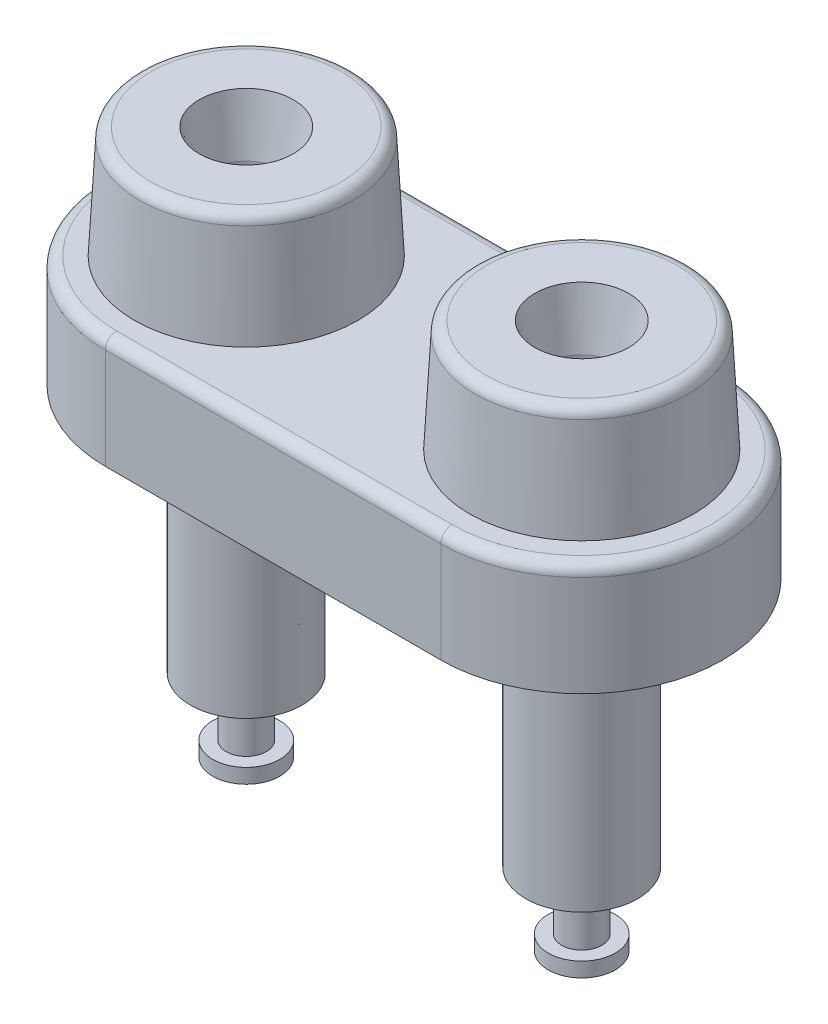
ISO-10303-21;
HEADER;
FILE_DESCRIPTION(('STEP AP214'),'2;1');
FILE_NAME('part.step','',(''),(''),'','','');
FILE_SCHEMA(('AUTOMOTIVE_DESIGN { 1 0 10303 214 1 1 1 1 }'));
ENDSEC;
DATA;
#1=APPLICATION_CONTEXT('core data for automotive mechanical design processes');
#2=APPLICATION_PROTOCOL_DEFINITION('international standard','automotive_design',2000,#1);
#3=PRODUCT_CONTEXT('',#1,'mechanical');
#4=PRODUCT('Part','Part','',(#3));
#5=PRODUCT_RELATED_PRODUCT_CATEGORY('part','',(#4));
#6=PRODUCT_DEFINITION_FORMATION('','',#4);
#7=PRODUCT_DEFINITION_CONTEXT('part definition',#1,'design');
#8=PRODUCT_DEFINITION('design','',#6,#7);
#9=PRODUCT_DEFINITION_SHAPE('','',#8);
#10=(LENGTH_UNIT() NAMED_UNIT(*) SI_UNIT(.MILLI.,.METRE.));
#11=(NAMED_UNIT(*) PLANE_ANGLE_UNIT() SI_UNIT($,.RADIAN.));
#12=(NAMED_UNIT(*) SI_UNIT($,.STERADIAN.) SOLID_ANGLE_UNIT());
#13=UNCERTAINTY_MEASURE_WITH_UNIT(LENGTH_MEASURE(1.E-05),#10,'distance_accuracy_value','');
#14=(GEOMETRIC_REPRESENTATION_CONTEXT(3) GLOBAL_UNCERTAINTY_ASSIGNED_CONTEXT((#13)) GLOBAL_UNIT_ASSIGNED_CONTEXT((#10,
#11,#12)) REPRESENTATION_CONTEXT('',''));
#15=CARTESIAN_POINT('',(0.,0.,0.));
#16=DIRECTION('',(0.,0.,1.));
#17=DIRECTION('',(1.,0.,0.));
#18=AXIS2_PLACEMENT_3D('',#15,#16,#17);
#19=CARTESIAN_POINT('',(-9.525,-0.889,0.));
#20=DIRECTION('',(0.,-1.,0.));
#21=DIRECTION('',(0.,0.,-1.));
#22=AXIS2_PLACEMENT_3D('',#19,#20,#21);
#23=PLANE('',#22);
#24=CARTESIAN_POINT('',(-9.525,-0.889,0.));
#25=DIRECTION('',(0.,-1.,0.));
#26=DIRECTION('',(0.,0.,-1.));
#27=AXIS2_PLACEMENT_3D('',#24,#25,#26);
#28=CIRCLE('',#27,4.699);
#29=CARTESIAN_POINT('',(-9.525,-0.889,-4.699));
#30=VERTEX_POINT('',#29);
#31=EDGE_CURVE('E225',#30,#30,#28,.T.);
#32=ORIENTED_EDGE('',*,*,#31,.T.);
#33=EDGE_LOOP('',(#32));
#34=FACE_BOUND('',#33,.T.);
#35=CARTESIAN_POINT('',(-9.525,-0.889,0.));
#36=DIRECTION('',(0.,-1.,0.));
#37=DIRECTION('',(0.,0.,-1.));
#38=AXIS2_PLACEMENT_3D('',#35,#36,#37);
#39=CIRCLE('',#38,3.175);
#40=CARTESIAN_POINT('',(-9.525,-0.889,-3.175));
#41=VERTEX_POINT('',#40);
#42=EDGE_CURVE('E178',#41,#41,#39,.T.);
#43=ORIENTED_EDGE('',*,*,#42,.F.);
#44=EDGE_LOOP('',(#43));
#45=FACE_BOUND('',#44,.T.);
#46=ADVANCED_FACE('F45',(#34,#45),#23,.T.);
#47=CARTESIAN_POINT('',(9.525,-0.889,0.));
#48=DIRECTION('',(0.,-1.,0.));
#49=DIRECTION('',(0.,0.,-1.));
#50=AXIS2_PLACEMENT_3D('',#47,#48,#49);
#51=PLANE('',#50);
#52=CARTESIAN_POINT('',(9.525,-0.889,0.));
#53=DIRECTION('',(0.,-1.,0.));
#54=DIRECTION('',(0.,0.,-1.));
#55=AXIS2_PLACEMENT_3D('',#52,#53,#54);
#56=CIRCLE('',#55,4.699);
#57=CARTESIAN_POINT('',(9.525,-0.889,-4.699));
#58=VERTEX_POINT('',#57);
#59=EDGE_CURVE('E222',#58,#58,#56,.T.);
#60=ORIENTED_EDGE('',*,*,#59,.T.);
#61=EDGE_LOOP('',(#60));
#62=FACE_BOUND('',#61,.T.);
#63=CARTESIAN_POINT('',(9.525,-0.889,0.));
#64=DIRECTION('',(0.,-1.,0.));
#65=DIRECTION('',(0.,0.,-1.));
#66=AXIS2_PLACEMENT_3D('',#63,#64,#65);
#67=CIRCLE('',#66,3.175);
#68=CARTESIAN_POINT('',(9.525,-0.889,-3.175));
#69=VERTEX_POINT('',#68);
#70=EDGE_CURVE('E204',#69,#69,#67,.T.);
#71=ORIENTED_EDGE('',*,*,#70,.F.);
#72=EDGE_LOOP('',(#71));
#73=FACE_BOUND('',#72,.T.);
#74=ADVANCED_FACE('F241',(#62,#73),#51,.T.);
#75=CARTESIAN_POINT('',(-9.525,0.,0.));
#76=DIRECTION('',(0.,1.,0.));
#77=DIRECTION('',(0.,0.,1.));
#78=AXIS2_PLACEMENT_3D('',#75,#76,#77);
#79=PLANE('',#78);
#80=CARTESIAN_POINT('',(-9.525,0.,0.));
#81=DIRECTION('',(0.,1.,0.));
#82=DIRECTION('',(0.,0.,1.));
#83=AXIS2_PLACEMENT_3D('',#80,#81,#82);
#84=CIRCLE('',#83,8.001);
#85=CARTESIAN_POINT('',(-9.525,0.,-8.001));
#86=VERTEX_POINT('',#85);
#87=CARTESIAN_POINT('',(-9.525,0.,8.001));
#88=VERTEX_POINT('',#87);
#89=EDGE_CURVE('E118',#86,#88,#84,.T.);
#90=ORIENTED_EDGE('',*,*,#89,.F.);
#91=DIRECTION('',(-1.,0.,0.));
#92=VECTOR('',#91,1.);
#93=CARTESIAN_POINT('',(-9.525,0.,-8.001));
#94=LINE('',#93,#92);
#95=CARTESIAN_POINT('',(9.525,0.,-8.001));
#96=VERTEX_POINT('',#95);
#97=EDGE_CURVE('E133',#96,#86,#94,.T.);
#98=ORIENTED_EDGE('',*,*,#97,.F.);
#99=CARTESIAN_POINT('',(9.525,0.,0.));
#100=DIRECTION('',(0.,1.,0.));
#101=DIRECTION('',(0.,0.,1.));
#102=AXIS2_PLACEMENT_3D('',#99,#100,#101);
#103=CIRCLE('',#102,8.001);
#104=CARTESIAN_POINT('',(9.525,0.,8.001));
#105=VERTEX_POINT('',#104);
#106=EDGE_CURVE('E120',#105,#96,#103,.T.);
#107=ORIENTED_EDGE('',*,*,#106,.F.);
#108=DIRECTION('',(1.,0.,0.));
#109=VECTOR('',#108,1.);
#110=CARTESIAN_POINT('',(-9.525,0.,8.001));
#111=LINE('',#110,#109);
#112=EDGE_CURVE('E103',#88,#105,#111,.T.);
#113=ORIENTED_EDGE('',*,*,#112,.F.);
#114=EDGE_LOOP('',(#90,#98,#107,#113));
#115=FACE_BOUND('',#114,.T.);
#116=CARTESIAN_POINT('',(-9.525,0.,0.));
#117=DIRECTION('',(0.,1.,0.));
#118=DIRECTION('',(0.,0.,1.));
#119=AXIS2_PLACEMENT_3D('',#116,#117,#118);
#120=CIRCLE('',#119,4.699);
#121=CARTESIAN_POINT('',(-9.525,0.,4.699));
#122=VERTEX_POINT('',#121);
#123=EDGE_CURVE('E110',#122,#122,#120,.F.);
#124=ORIENTED_EDGE('',*,*,#123,.F.);
#125=EDGE_LOOP('',(#124));
#126=FACE_BOUND('',#125,.T.);
#127=CARTESIAN_POINT('',(9.525,0.,0.));
#128=DIRECTION('',(0.,1.,0.));
#129=DIRECTION('',(0.,0.,1.));
#130=AXIS2_PLACEMENT_3D('',#127,#128,#129);
#131=CIRCLE('',#130,4.699);
#132=CARTESIAN_POINT('',(9.525,0.,4.699));
#133=VERTEX_POINT('',#132);
#134=EDGE_CURVE('E141',#133,#133,#131,.F.);
#135=ORIENTED_EDGE('',*,*,#134,.F.);
#136=EDGE_LOOP('',(#135));
#137=FACE_BOUND('',#136,.T.);
#138=ADVANCED_FACE('F115',(#115,#126,#137),#79,.F.);
#139=CARTESIAN_POINT('',(-9.525,6.35,0.));
#140=DIRECTION('',(0.,1.,0.));
#141=DIRECTION('',(0.,0.,1.));
#142=AXIS2_PLACEMENT_3D('',#139,#140,#141);
#143=PLANE('',#142);
#144=DIRECTION('',(-1.,0.,0.));
#145=VECTOR('',#144,1.);
#146=CARTESIAN_POINT('',(-9.525,6.35,-7.366));
#147=LINE('',#146,#145);
#148=CARTESIAN_POINT('',(9.525,6.35,-7.366));
#149=VERTEX_POINT('',#148);
#150=CARTESIAN_POINT('',(-9.525,6.35,-7.366));
#151=VERTEX_POINT('',#150);
#152=EDGE_CURVE('E148',#149,#151,#147,.T.);
#153=ORIENTED_EDGE('',*,*,#152,.T.);
#154=CARTESIAN_POINT('',(-9.525,6.35,0.));
#155=DIRECTION('',(0.,1.,0.));
#156=DIRECTION('',(0.,0.,1.));
#157=AXIS2_PLACEMENT_3D('',#154,#155,#156);
#158=CIRCLE('',#157,7.366);
#159=CARTESIAN_POINT('',(-9.525,6.35,7.366));
#160=VERTEX_POINT('',#159);
#161=EDGE_CURVE('E150',#151,#160,#158,.T.);
#162=ORIENTED_EDGE('',*,*,#161,.T.);
#163=DIRECTION('',(1.,0.,0.));
#164=VECTOR('',#163,1.);
#165=CARTESIAN_POINT('',(9.52500000000001,6.35,7.366));
#166=LINE('',#165,#164);
#167=CARTESIAN_POINT('',(9.525,6.35,7.366));
#168=VERTEX_POINT('',#167);
#169=EDGE_CURVE('E144',#160,#168,#166,.T.);
#170=ORIENTED_EDGE('',*,*,#169,.T.);
#171=CARTESIAN_POINT('',(9.525,6.35,0.));
#172=DIRECTION('',(0.,1.,0.));
#173=DIRECTION('',(0.,0.,1.));
#174=AXIS2_PLACEMENT_3D('',#171,#172,#173);
#175=CIRCLE('',#174,7.366);
#176=EDGE_CURVE('E146',#168,#149,#175,.T.);
#177=ORIENTED_EDGE('',*,*,#176,.T.);
#178=EDGE_LOOP('',(#153,#162,#170,#177));
#179=FACE_BOUND('',#178,.T.);
#180=CARTESIAN_POINT('',(-9.525,6.35,0.));
#181=DIRECTION('',(0.,1.,0.));
#182=DIRECTION('',(0.,0.,1.));
#183=AXIS2_PLACEMENT_3D('',#180,#181,#182);
#184=CIRCLE('',#183,6.35);
#185=CARTESIAN_POINT('',(-9.525,6.35,6.35));
#186=VERTEX_POINT('',#185);
#187=EDGE_CURVE('E125',#186,#186,#184,.T.);
#188=ORIENTED_EDGE('',*,*,#187,.F.);
#189=EDGE_LOOP('',(#188));
#190=FACE_BOUND('',#189,.T.);
#191=CARTESIAN_POINT('',(9.525,6.35,0.));
#192=DIRECTION('',(0.,1.,0.));
#193=DIRECTION('',(0.,0.,-1.));
#194=AXIS2_PLACEMENT_3D('',#191,#192,#193);
#195=CIRCLE('',#194,6.35);
#196=CARTESIAN_POINT('',(9.525,6.35,-6.35));
#197=VERTEX_POINT('',#196);
#198=EDGE_CURVE('E128',#197,#197,#195,.T.);
#199=ORIENTED_EDGE('',*,*,#198,.F.);
#200=EDGE_LOOP('',(#199));
#201=FACE_BOUND('',#200,.T.);
#202=ADVANCED_FACE('F232',(#179,#190,#201),#143,.T.);
#203=CARTESIAN_POINT('',(-9.525,6.35,0.));
#204=DIRECTION('',(0.,-1.,0.));
#205=DIRECTION('',(0.,0.,-1.));
#206=AXIS2_PLACEMENT_3D('',#203,#204,#205);
#207=CYLINDRICAL_SURFACE('',#206,8.001);
#208=DIRECTION('',(0.,-1.,0.));
#209=VECTOR('',#208,1.);
#210=CARTESIAN_POINT('',(-9.525,6.35,8.001));
#211=LINE('',#210,#209);
#212=CARTESIAN_POINT('',(-9.525,5.715,8.001));
#213=VERTEX_POINT('',#212);
#214=EDGE_CURVE('E100',#213,#88,#211,.T.);
#215=ORIENTED_EDGE('',*,*,#214,.F.);
#216=CARTESIAN_POINT('',(-9.525,5.715,0.));
#217=DIRECTION('',(0.,1.,0.));
#218=DIRECTION('',(0.,0.,1.));
#219=AXIS2_PLACEMENT_3D('',#216,#217,#218);
#220=CIRCLE('',#219,8.001);
#221=CARTESIAN_POINT('',(-9.525,5.715,-8.001));
#222=VERTEX_POINT('',#221);
#223=EDGE_CURVE('E153',#213,#222,#220,.F.);
#224=ORIENTED_EDGE('',*,*,#223,.T.);
#225=DIRECTION('',(0.,-1.,0.));
#226=VECTOR('',#225,1.);
#227=CARTESIAN_POINT('',(-9.525,6.35,-8.001));
#228=LINE('',#227,#226);
#229=EDGE_CURVE('E123',#222,#86,#228,.T.);
#230=ORIENTED_EDGE('',*,*,#229,.T.);
#231=ORIENTED_EDGE('',*,*,#89,.T.);
#232=EDGE_LOOP('',(#215,#224,#230,#231));
#233=FACE_BOUND('',#232,.T.);
#234=ADVANCED_FACE('F122',(#233),#207,.T.);
#235=CARTESIAN_POINT('',(-9.525,6.35,8.001));
#236=DIRECTION('',(0.,0.,-1.));
#237=DIRECTION('',(-1.,0.,0.));
#238=AXIS2_PLACEMENT_3D('',#235,#236,#237);
#239=PLANE('',#238);
#240=DIRECTION('',(0.,-1.,0.));
#241=VECTOR('',#240,1.);
#242=CARTESIAN_POINT('',(9.525,6.35,8.001));
#243=LINE('',#242,#241);
#244=CARTESIAN_POINT('',(9.525,5.715,8.001));
#245=VERTEX_POINT('',#244);
#246=EDGE_CURVE('E111',#245,#105,#243,.T.);
#247=ORIENTED_EDGE('',*,*,#246,.F.);
#248=DIRECTION('',(1.,0.,0.));
#249=VECTOR('',#248,1.);
#250=CARTESIAN_POINT('',(-9.525,5.715,8.001));
#251=LINE('',#250,#249);
#252=EDGE_CURVE('E11',#245,#213,#251,.F.);
#253=ORIENTED_EDGE('',*,*,#252,.T.);
#254=ORIENTED_EDGE('',*,*,#214,.T.);
#255=ORIENTED_EDGE('',*,*,#112,.T.);
#256=EDGE_LOOP('',(#247,#253,#254,#255));
#257=FACE_BOUND('',#256,.T.);
#258=ADVANCED_FACE('F102',(#257),#239,.F.);
#259=CARTESIAN_POINT('',(9.525,6.35,0.));
#260=DIRECTION('',(0.,-1.,0.));
#261=DIRECTION('',(0.,0.,-1.));
#262=AXIS2_PLACEMENT_3D('',#259,#260,#261);
#263=CYLINDRICAL_SURFACE('',#262,8.001);
#264=DIRECTION('',(0.,-1.,0.));
#265=VECTOR('',#264,1.);
#266=CARTESIAN_POINT('',(9.525,6.35,-8.001));
#267=LINE('',#266,#265);
#268=CARTESIAN_POINT('',(9.525,5.715,-8.001));
#269=VERTEX_POINT('',#268);
#270=EDGE_CURVE('E136',#269,#96,#267,.T.);
#271=ORIENTED_EDGE('',*,*,#270,.F.);
#272=CARTESIAN_POINT('',(9.525,5.715,0.));
#273=DIRECTION('',(0.,1.,0.));
#274=DIRECTION('',(0.,0.,1.));
#275=AXIS2_PLACEMENT_3D('',#272,#273,#274);
#276=CIRCLE('',#275,8.001);
#277=EDGE_CURVE('E62',#269,#245,#276,.F.);
#278=ORIENTED_EDGE('',*,*,#277,.T.);
#279=ORIENTED_EDGE('',*,*,#246,.T.);
#280=ORIENTED_EDGE('',*,*,#106,.T.);
#281=EDGE_LOOP('',(#271,#278,#279,#280));
#282=FACE_BOUND('',#281,.T.);
#283=ADVANCED_FACE('F281',(#282),#263,.T.);
#284=CARTESIAN_POINT('',(-9.525,6.35,-8.001));
#285=DIRECTION('',(0.,0.,1.));
#286=DIRECTION('',(1.,0.,0.));
#287=AXIS2_PLACEMENT_3D('',#284,#285,#286);
#288=PLANE('',#287);
#289=ORIENTED_EDGE('',*,*,#229,.F.);
#290=DIRECTION('',(-1.,0.,0.));
#291=VECTOR('',#290,1.);
#292=CARTESIAN_POINT('',(9.525,5.715,-8.001));
#293=LINE('',#292,#291);
#294=EDGE_CURVE('E70',#222,#269,#293,.F.);
#295=ORIENTED_EDGE('',*,*,#294,.T.);
#296=ORIENTED_EDGE('',*,*,#270,.T.);
#297=ORIENTED_EDGE('',*,*,#97,.T.);
#298=EDGE_LOOP('',(#289,#295,#296,#297));
#299=FACE_BOUND('',#298,.T.);
#300=ADVANCED_FACE('F275',(#299),#288,.F.);
#301=CARTESIAN_POINT('',(-9.525,6.35,0.));
#302=DIRECTION('',(0.,-1.,0.));
#303=DIRECTION('',(0.,0.,1.));
#304=AXIS2_PLACEMENT_3D('',#301,#302,#303);
#305=CONICAL_SURFACE('',#304,6.35,0.0523598775598299);
#306=CARTESIAN_POINT('',(-9.525,12.0982333322143,0.));
#307=DIRECTION('',(0.,-1.,0.));
#308=DIRECTION('',(0.,0.,-1.));
#309=AXIS2_PLACEMENT_3D('',#306,#307,#308);
#310=CIRCLE('',#309,6.04874785625789);
#311=CARTESIAN_POINT('',(-9.525,12.0982333322143,-6.04874785625789));
#312=VERTEX_POINT('',#311);
#313=EDGE_CURVE('E54',#312,#312,#310,.T.);
#314=ORIENTED_EDGE('',*,*,#313,.T.);
#315=EDGE_LOOP('',(#314));
#316=FACE_BOUND('',#315,.T.);
#317=ORIENTED_EDGE('',*,*,#187,.T.);
#318=EDGE_LOOP('',(#317));
#319=FACE_BOUND('',#318,.T.);
#320=ADVANCED_FACE('F272',(#316,#319),#305,.T.);
#321=CARTESIAN_POINT('',(-9.525,12.7,0.));
#322=DIRECTION('',(0.,1.,0.));
#323=DIRECTION('',(0.,0.,1.));
#324=AXIS2_PLACEMENT_3D('',#321,#322,#323);
#325=PLANE('',#324);
#326=CARTESIAN_POINT('',(-9.525,12.7,0.));
#327=DIRECTION('',(0.,1.,0.));
#328=DIRECTION('',(0.,0.,1.));
#329=AXIS2_PLACEMENT_3D('',#326,#327,#328);
#330=CIRCLE('',#329,2.66803816374935);
#331=CARTESIAN_POINT('',(-9.525,12.7,2.66803816374935));
#332=VERTEX_POINT('',#331);
#333=EDGE_CURVE('E759',#332,#332,#330,.F.);
#334=ORIENTED_EDGE('',*,*,#333,.T.);
#335=EDGE_LOOP('',(#334));
#336=FACE_BOUND('',#335,.T.);
#337=CARTESIAN_POINT('',(-9.525,12.7,0.));
#338=DIRECTION('',(0.,1.,0.));
#339=DIRECTION('',(0.,0.,1.));
#340=AXIS2_PLACEMENT_3D('',#337,#338,#339);
#341=CIRCLE('',#340,5.41461810168874);
#342=CARTESIAN_POINT('',(-9.525,12.7,5.41461810168874));
#343=VERTEX_POINT('',#342);
#344=EDGE_CURVE('E163',#343,#343,#341,.T.);
#345=ORIENTED_EDGE('',*,*,#344,.T.);
#346=EDGE_LOOP('',(#345));
#347=FACE_BOUND('',#346,.T.);
#348=ADVANCED_FACE('F269',(#336,#347),#325,.T.);
#349=CARTESIAN_POINT('',(9.525,6.35,0.));
#350=DIRECTION('',(0.,-1.,0.));
#351=DIRECTION('',(0.,0.,-1.));
#352=AXIS2_PLACEMENT_3D('',#349,#350,#351);
#353=CONICAL_SURFACE('',#352,6.35,0.0523598775598299);
#354=CARTESIAN_POINT('',(9.525,12.0982333322143,0.));
#355=DIRECTION('',(0.,1.,0.));
#356=DIRECTION('',(0.,0.,1.));
#357=AXIS2_PLACEMENT_3D('',#354,#355,#356);
#358=CIRCLE('',#357,6.04874785625789);
#359=CARTESIAN_POINT('',(9.525,12.0982333322143,6.04874785625789));
#360=VERTEX_POINT('',#359);
#361=EDGE_CURVE('E160',#360,#360,#358,.F.);
#362=ORIENTED_EDGE('',*,*,#361,.T.);
#363=EDGE_LOOP('',(#362));
#364=FACE_BOUND('',#363,.T.);
#365=ORIENTED_EDGE('',*,*,#198,.T.);
#366=EDGE_LOOP('',(#365));
#367=FACE_BOUND('',#366,.T.);
#368=ADVANCED_FACE('F230',(#364,#367),#353,.T.);
#369=CARTESIAN_POINT('',(9.525,12.7,0.));
#370=DIRECTION('',(0.,-1.,0.));
#371=DIRECTION('',(0.,0.,-1.));
#372=AXIS2_PLACEMENT_3D('',#369,#370,#371);
#373=PLANE('',#372);
#374=CARTESIAN_POINT('',(9.525,12.7,0.));
#375=DIRECTION('',(0.,-1.,0.));
#376=DIRECTION('',(0.,0.,-1.));
#377=AXIS2_PLACEMENT_3D('',#374,#375,#376);
#378=CIRCLE('',#377,2.66803816374935);
#379=CARTESIAN_POINT('',(9.525,12.7,-2.66803816374935));
#380=VERTEX_POINT('',#379);
#381=EDGE_CURVE('E767',#380,#380,#378,.F.);
#382=ORIENTED_EDGE('',*,*,#381,.F.);
#383=EDGE_LOOP('',(#382));
#384=FACE_BOUND('',#383,.T.);
#385=CARTESIAN_POINT('',(9.525,12.7,0.));
#386=DIRECTION('',(0.,-1.,0.));
#387=DIRECTION('',(0.,0.,-1.));
#388=AXIS2_PLACEMENT_3D('',#385,#386,#387);
#389=CIRCLE('',#388,5.41461810168874);
#390=CARTESIAN_POINT('',(9.525,12.7,-5.41461810168874));
#391=VERTEX_POINT('',#390);
#392=EDGE_CURVE('E157',#391,#391,#389,.F.);
#393=ORIENTED_EDGE('',*,*,#392,.T.);
#394=EDGE_LOOP('',(#393));
#395=FACE_BOUND('',#394,.T.);
#396=ADVANCED_FACE('F262',(#384,#395),#373,.F.);
#397=CARTESIAN_POINT('',(-9.525,-0.889,0.));
#398=DIRECTION('',(0.,1.,0.));
#399=DIRECTION('',(0.,0.,1.));
#400=AXIS2_PLACEMENT_3D('',#397,#398,#399);
#401=CYLINDRICAL_SURFACE('',#400,4.699);
#402=ORIENTED_EDGE('',*,*,#31,.F.);
#403=EDGE_LOOP('',(#402));
#404=FACE_BOUND('',#403,.T.);
#405=ORIENTED_EDGE('',*,*,#123,.T.);
#406=EDGE_LOOP('',(#405));
#407=FACE_BOUND('',#406,.T.);
#408=ADVANCED_FACE('F259',(#404,#407),#401,.T.);
#409=CARTESIAN_POINT('',(9.525,-0.889,0.));
#410=DIRECTION('',(0.,1.,0.));
#411=DIRECTION('',(0.,0.,1.));
#412=AXIS2_PLACEMENT_3D('',#409,#410,#411);
#413=CYLINDRICAL_SURFACE('',#412,4.699);
#414=ORIENTED_EDGE('',*,*,#59,.F.);
#415=EDGE_LOOP('',(#414));
#416=FACE_BOUND('',#415,.T.);
#417=ORIENTED_EDGE('',*,*,#134,.T.);
#418=EDGE_LOOP('',(#417));
#419=FACE_BOUND('',#418,.T.);
#420=ADVANCED_FACE('F258',(#416,#419),#413,.T.);
#421=CARTESIAN_POINT('',(9.525,-18.288,0.));
#422=DIRECTION('',(0.,1.,0.));
#423=DIRECTION('',(0.,0.,1.));
#424=AXIS2_PLACEMENT_3D('',#421,#422,#423);
#425=PLANE('',#424);
#426=CARTESIAN_POINT('',(9.525,-18.288,0.));
#427=DIRECTION('',(0.,-1.,0.));
#428=DIRECTION('',(0.,0.,-1.));
#429=AXIS2_PLACEMENT_3D('',#426,#427,#428);
#430=CIRCLE('',#429,1.905);
#431=CARTESIAN_POINT('',(9.525,-18.288,-1.905));
#432=VERTEX_POINT('',#431);
#433=EDGE_CURVE('E219',#432,#432,#430,.T.);
#434=ORIENTED_EDGE('',*,*,#433,.T.);
#435=EDGE_LOOP('',(#434));
#436=FACE_BOUND('',#435,.T.);
#437=ADVANCED_FACE('F479',(#436),#425,.F.);
#438=CARTESIAN_POINT('',(9.525,-0.889,0.));
#439=DIRECTION('',(0.,-1.,0.));
#440=DIRECTION('',(0.,0.,-1.));
#441=AXIS2_PLACEMENT_3D('',#438,#439,#440);
#442=CYLINDRICAL_SURFACE('',#441,1.905);
#443=ORIENTED_EDGE('',*,*,#433,.F.);
#444=EDGE_LOOP('',(#443));
#445=FACE_BOUND('',#444,.T.);
#446=CARTESIAN_POINT('',(9.525,-17.4568765921449,0.));
#447=DIRECTION('',(0.,-1.,0.));
#448=DIRECTION('',(0.,0.,-1.));
#449=AXIS2_PLACEMENT_3D('',#446,#447,#448);
#450=CIRCLE('',#449,1.905);
#451=CARTESIAN_POINT('',(9.525,-17.4568765921449,-1.905));
#452=VERTEX_POINT('',#451);
#453=EDGE_CURVE('E216',#452,#452,#450,.T.);
#454=ORIENTED_EDGE('',*,*,#453,.T.);
#455=EDGE_LOOP('',(#454));
#456=FACE_BOUND('',#455,.T.);
#457=ADVANCED_FACE('F475',(#445,#456),#442,.T.);
#458=CARTESIAN_POINT('',(7.62,-17.4568765921449,0.));
#459=DIRECTION('',(0.,-1.,0.));
#460=DIRECTION('',(0.,0.,-1.));
#461=AXIS2_PLACEMENT_3D('',#458,#459,#460);
#462=PLANE('',#461);
#463=ORIENTED_EDGE('',*,*,#453,.F.);
#464=EDGE_LOOP('',(#463));
#465=FACE_BOUND('',#464,.T.);
#466=CARTESIAN_POINT('',(9.525,-17.4568765921449,0.));
#467=DIRECTION('',(0.,-1.,0.));
#468=DIRECTION('',(0.,0.,-1.));
#469=AXIS2_PLACEMENT_3D('',#466,#467,#468);
#470=CIRCLE('',#469,1.143);
#471=CARTESIAN_POINT('',(9.525,-17.4568765921449,-1.143));
#472=VERTEX_POINT('',#471);
#473=EDGE_CURVE('E213',#472,#472,#470,.T.);
#474=ORIENTED_EDGE('',*,*,#473,.T.);
#475=EDGE_LOOP('',(#474));
#476=FACE_BOUND('',#475,.T.);
#477=ADVANCED_FACE('F471',(#465,#476),#462,.F.);
#478=CARTESIAN_POINT('',(9.525,-0.889,0.));
#479=DIRECTION('',(0.,-1.,0.));
#480=DIRECTION('',(0.,0.,-1.));
#481=AXIS2_PLACEMENT_3D('',#478,#479,#480);
#482=CYLINDRICAL_SURFACE('',#481,1.143);
#483=ORIENTED_EDGE('',*,*,#473,.F.);
#484=EDGE_LOOP('',(#483));
#485=FACE_BOUND('',#484,.T.);
#486=CARTESIAN_POINT('',(9.525,-14.1548765921449,0.));
#487=DIRECTION('',(0.,-1.,0.));
#488=DIRECTION('',(0.,0.,-1.));
#489=AXIS2_PLACEMENT_3D('',#486,#487,#488);
#490=CIRCLE('',#489,1.14299999999999);
#491=CARTESIAN_POINT('',(9.525,-14.1548765921449,-1.143));
#492=VERTEX_POINT('',#491);
#493=EDGE_CURVE('E210',#492,#492,#490,.T.);
#494=ORIENTED_EDGE('',*,*,#493,.T.);
#495=EDGE_LOOP('',(#494));
#496=FACE_BOUND('',#495,.T.);
#497=ADVANCED_FACE('F467',(#485,#496),#482,.T.);
#498=CARTESIAN_POINT('',(8.38200000000001,-14.1548765921449,0.));
#499=DIRECTION('',(0.,1.,0.));
#500=DIRECTION('',(0.,0.,1.));
#501=AXIS2_PLACEMENT_3D('',#498,#499,#500);
#502=PLANE('',#501);
#503=ORIENTED_EDGE('',*,*,#493,.F.);
#504=EDGE_LOOP('',(#503));
#505=FACE_BOUND('',#504,.T.);
#506=CARTESIAN_POINT('',(9.525,-14.1548765921449,0.));
#507=DIRECTION('',(0.,-1.,0.));
#508=DIRECTION('',(0.,0.,-1.));
#509=AXIS2_PLACEMENT_3D('',#506,#507,#508);
#510=CIRCLE('',#509,3.175);
#511=CARTESIAN_POINT('',(9.525,-14.1548765921449,-3.175));
#512=VERTEX_POINT('',#511);
#513=EDGE_CURVE('E207',#512,#512,#510,.T.);
#514=ORIENTED_EDGE('',*,*,#513,.T.);
#515=EDGE_LOOP('',(#514));
#516=FACE_BOUND('',#515,.T.);
#517=ADVANCED_FACE('F463',(#505,#516),#502,.F.);
#518=CARTESIAN_POINT('',(9.525,-0.889,0.));
#519=DIRECTION('',(0.,-1.,0.));
#520=DIRECTION('',(0.,0.,-1.));
#521=AXIS2_PLACEMENT_3D('',#518,#519,#520);
#522=CYLINDRICAL_SURFACE('',#521,3.175);
#523=ORIENTED_EDGE('',*,*,#513,.F.);
#524=EDGE_LOOP('',(#523));
#525=FACE_BOUND('',#524,.T.);
#526=ORIENTED_EDGE('',*,*,#70,.T.);
#527=EDGE_LOOP('',(#526));
#528=FACE_BOUND('',#527,.T.);
#529=ADVANCED_FACE('F459',(#525,#528),#522,.T.);
#530=CARTESIAN_POINT('',(-9.525,-18.288,0.));
#531=DIRECTION('',(0.,1.,0.));
#532=DIRECTION('',(0.,0.,1.));
#533=AXIS2_PLACEMENT_3D('',#530,#531,#532);
#534=PLANE('',#533);
#535=CARTESIAN_POINT('',(-9.525,-18.288,0.));
#536=DIRECTION('',(0.,-1.,0.));
#537=DIRECTION('',(0.,0.,-1.));
#538=AXIS2_PLACEMENT_3D('',#535,#536,#537);
#539=CIRCLE('',#538,1.905);
#540=CARTESIAN_POINT('',(-9.525,-18.288,-1.905));
#541=VERTEX_POINT('',#540);
#542=EDGE_CURVE('E201',#541,#541,#539,.T.);
#543=ORIENTED_EDGE('',*,*,#542,.T.);
#544=EDGE_LOOP('',(#543));
#545=FACE_BOUND('',#544,.T.);
#546=ADVANCED_FACE('F455',(#545),#534,.F.);
#547=CARTESIAN_POINT('',(-9.525,-0.889,0.));
#548=DIRECTION('',(0.,-1.,0.));
#549=DIRECTION('',(0.,0.,-1.));
#550=AXIS2_PLACEMENT_3D('',#547,#548,#549);
#551=CYLINDRICAL_SURFACE('',#550,1.905);
#552=ORIENTED_EDGE('',*,*,#542,.F.);
#553=EDGE_LOOP('',(#552));
#554=FACE_BOUND('',#553,.T.);
#555=CARTESIAN_POINT('',(-9.525,-17.4568765921449,0.));
#556=DIRECTION('',(0.,-1.,0.));
#557=DIRECTION('',(0.,0.,-1.));
#558=AXIS2_PLACEMENT_3D('',#555,#556,#557);
#559=CIRCLE('',#558,1.905);
#560=CARTESIAN_POINT('',(-9.525,-17.4568765921449,-1.905));
#561=VERTEX_POINT('',#560);
#562=EDGE_CURVE('E198',#561,#561,#559,.T.);
#563=ORIENTED_EDGE('',*,*,#562,.T.);
#564=EDGE_LOOP('',(#563));
#565=FACE_BOUND('',#564,.T.);
#566=ADVANCED_FACE('F451',(#554,#565),#551,.T.);
#567=CARTESIAN_POINT('',(-11.43,-17.4568765921449,0.));
#568=DIRECTION('',(0.,-1.,0.));
#569=DIRECTION('',(0.,0.,-1.));
#570=AXIS2_PLACEMENT_3D('',#567,#568,#569);
#571=PLANE('',#570);
#572=ORIENTED_EDGE('',*,*,#562,.F.);
#573=EDGE_LOOP('',(#572));
#574=FACE_BOUND('',#573,.T.);
#575=CARTESIAN_POINT('',(-9.525,-17.4568765921449,0.));
#576=DIRECTION('',(0.,-1.,0.));
#577=DIRECTION('',(0.,0.,-1.));
#578=AXIS2_PLACEMENT_3D('',#575,#576,#577);
#579=CIRCLE('',#578,1.143);
#580=CARTESIAN_POINT('',(-9.525,-17.4568765921449,-1.143));
#581=VERTEX_POINT('',#580);
#582=EDGE_CURVE('E195',#581,#581,#579,.T.);
#583=ORIENTED_EDGE('',*,*,#582,.T.);
#584=EDGE_LOOP('',(#583));
#585=FACE_BOUND('',#584,.T.);
#586=ADVANCED_FACE('F448',(#574,#585),#571,.F.);
#587=CARTESIAN_POINT('',(-9.525,-0.889,0.));
#588=DIRECTION('',(0.,-1.,0.));
#589=DIRECTION('',(0.,0.,-1.));
#590=AXIS2_PLACEMENT_3D('',#587,#588,#589);
#591=CYLINDRICAL_SURFACE('',#590,1.143);
#592=ORIENTED_EDGE('',*,*,#582,.F.);
#593=EDGE_LOOP('',(#592));
#594=FACE_BOUND('',#593,.T.);
#595=CARTESIAN_POINT('',(-9.525,-14.1548765921449,0.));
#596=DIRECTION('',(0.,-1.,0.));
#597=DIRECTION('',(0.,0.,-1.));
#598=AXIS2_PLACEMENT_3D('',#595,#596,#597);
#599=CIRCLE('',#598,1.14299999999999);
#600=CARTESIAN_POINT('',(-9.525,-14.1548765921449,-1.14299999999999));
#601=VERTEX_POINT('',#600);
#602=EDGE_CURVE('E188',#601,#601,#599,.T.);
#603=ORIENTED_EDGE('',*,*,#602,.T.);
#604=EDGE_LOOP('',(#603));
#605=FACE_BOUND('',#604,.T.);
#606=ADVANCED_FACE('F444',(#594,#605),#591,.T.);
#607=CARTESIAN_POINT('',(-10.668,-14.1548765921449,0.));
#608=DIRECTION('',(0.,1.,0.));
#609=DIRECTION('',(0.,0.,1.));
#610=AXIS2_PLACEMENT_3D('',#607,#608,#609);
#611=PLANE('',#610);
#612=ORIENTED_EDGE('',*,*,#602,.F.);
#613=EDGE_LOOP('',(#612));
#614=FACE_BOUND('',#613,.T.);
#615=CARTESIAN_POINT('',(-9.525,-14.1548765921449,0.));
#616=DIRECTION('',(0.,-1.,0.));
#617=DIRECTION('',(0.,0.,-1.));
#618=AXIS2_PLACEMENT_3D('',#615,#616,#617);
#619=CIRCLE('',#618,3.175);
#620=CARTESIAN_POINT('',(-9.525,-14.1548765921449,-3.175));
#621=VERTEX_POINT('',#620);
#622=EDGE_CURVE('E183',#621,#621,#619,.T.);
#623=ORIENTED_EDGE('',*,*,#622,.T.);
#624=EDGE_LOOP('',(#623));
#625=FACE_BOUND('',#624,.T.);
#626=ADVANCED_FACE('F440',(#614,#625),#611,.F.);
#627=CARTESIAN_POINT('',(-9.525,-0.889,0.));
#628=DIRECTION('',(0.,-1.,0.));
#629=DIRECTION('',(0.,0.,-1.));
#630=AXIS2_PLACEMENT_3D('',#627,#628,#629);
#631=CYLINDRICAL_SURFACE('',#630,3.175);
#632=ORIENTED_EDGE('',*,*,#622,.F.);
#633=EDGE_LOOP('',(#632));
#634=FACE_BOUND('',#633,.T.);
#635=ORIENTED_EDGE('',*,*,#42,.T.);
#636=EDGE_LOOP('',(#635));
#637=FACE_BOUND('',#636,.T.);
#638=ADVANCED_FACE('F315',(#634,#637),#631,.T.);
#639=CARTESIAN_POINT('',(9.525,5.715,0.));
#640=DIRECTION('',(0.,1.,0.));
#641=DIRECTION('',(0.,0.,1.));
#642=AXIS2_PLACEMENT_3D('',#639,#640,#641);
#643=TOROIDAL_SURFACE('',#642,7.366,0.635);
#644=CARTESIAN_POINT('',(9.525,5.715,7.366));
#645=DIRECTION('',(-1.,0.,0.));
#646=DIRECTION('',(0.,0.,1.));
#647=AXIS2_PLACEMENT_3D('',#644,#645,#646);
#648=CIRCLE('',#647,0.635);
#649=EDGE_CURVE('E172',#245,#168,#648,.T.);
#650=ORIENTED_EDGE('',*,*,#649,.F.);
#651=ORIENTED_EDGE('',*,*,#277,.F.);
#652=CARTESIAN_POINT('',(9.525,5.715,-7.366));
#653=DIRECTION('',(-1.,0.,0.));
#654=DIRECTION('',(0.,0.,1.));
#655=AXIS2_PLACEMENT_3D('',#652,#653,#654);
#656=CIRCLE('',#655,0.635);
#657=EDGE_CURVE('E49',#149,#269,#656,.T.);
#658=ORIENTED_EDGE('',*,*,#657,.F.);
#659=ORIENTED_EDGE('',*,*,#176,.F.);
#660=EDGE_LOOP('',(#650,#651,#658,#659));
#661=FACE_BOUND('',#660,.T.);
#662=ADVANCED_FACE('F311',(#661),#643,.T.);
#663=CARTESIAN_POINT('',(-9.525,5.715,-7.366));
#664=DIRECTION('',(1.,0.,0.));
#665=DIRECTION('',(0.,0.,-1.));
#666=AXIS2_PLACEMENT_3D('',#663,#664,#665);
#667=CYLINDRICAL_SURFACE('',#666,0.635);
#668=ORIENTED_EDGE('',*,*,#657,.T.);
#669=ORIENTED_EDGE('',*,*,#294,.F.);
#670=CARTESIAN_POINT('',(-9.525,5.715,-7.366));
#671=DIRECTION('',(-1.,0.,0.));
#672=DIRECTION('',(0.,0.,1.));
#673=AXIS2_PLACEMENT_3D('',#670,#671,#672);
#674=CIRCLE('',#673,0.635);
#675=EDGE_CURVE('E170',#151,#222,#674,.T.);
#676=ORIENTED_EDGE('',*,*,#675,.F.);
#677=ORIENTED_EDGE('',*,*,#152,.F.);
#678=EDGE_LOOP('',(#668,#669,#676,#677));
#679=FACE_BOUND('',#678,.T.);
#680=ADVANCED_FACE('F314',(#679),#667,.T.);
#681=CARTESIAN_POINT('',(-9.525,5.715,7.366));
#682=DIRECTION('',(-1.,0.,0.));
#683=DIRECTION('',(0.,0.,1.));
#684=AXIS2_PLACEMENT_3D('',#681,#682,#683);
#685=CYLINDRICAL_SURFACE('',#684,0.635);
#686=ORIENTED_EDGE('',*,*,#649,.T.);
#687=ORIENTED_EDGE('',*,*,#169,.F.);
#688=CARTESIAN_POINT('',(-9.525,5.715,7.366));
#689=DIRECTION('',(-1.,0.,0.));
#690=DIRECTION('',(0.,0.,1.));
#691=AXIS2_PLACEMENT_3D('',#688,#689,#690);
#692=CIRCLE('',#691,0.635);
#693=EDGE_CURVE('E168',#213,#160,#692,.T.);
#694=ORIENTED_EDGE('',*,*,#693,.F.);
#695=ORIENTED_EDGE('',*,*,#252,.F.);
#696=EDGE_LOOP('',(#686,#687,#694,#695));
#697=FACE_BOUND('',#696,.T.);
#698=ADVANCED_FACE('F305',(#697),#685,.T.);
#699=CARTESIAN_POINT('',(-9.525,5.715,0.));
#700=DIRECTION('',(0.,1.,0.));
#701=DIRECTION('',(0.,0.,1.));
#702=AXIS2_PLACEMENT_3D('',#699,#700,#701);
#703=TOROIDAL_SURFACE('',#702,7.366,0.635);
#704=ORIENTED_EDGE('',*,*,#675,.T.);
#705=ORIENTED_EDGE('',*,*,#223,.F.);
#706=ORIENTED_EDGE('',*,*,#693,.T.);
#707=ORIENTED_EDGE('',*,*,#161,.F.);
#708=EDGE_LOOP('',(#704,#705,#706,#707));
#709=FACE_BOUND('',#708,.T.);
#710=ADVANCED_FACE('F300',(#709),#703,.T.);
#711=CARTESIAN_POINT('',(9.525,12.065,0.));
#712=DIRECTION('',(0.,-1.,0.));
#713=DIRECTION('',(0.,0.,-1.));
#714=AXIS2_PLACEMENT_3D('',#711,#712,#713);
#715=TOROIDAL_SURFACE('',#714,5.41461810168874,0.635);
#716=ORIENTED_EDGE('',*,*,#361,.F.);
#717=EDGE_LOOP('',(#716));
#718=FACE_BOUND('',#717,.T.);
#719=ORIENTED_EDGE('',*,*,#392,.F.);
#720=EDGE_LOOP('',(#719));
#721=FACE_BOUND('',#720,.T.);
#722=ADVANCED_FACE('F290',(#718,#721),#715,.T.);
#723=CARTESIAN_POINT('',(-9.525,12.065,0.));
#724=DIRECTION('',(0.,1.,0.));
#725=DIRECTION('',(0.,0.,1.));
#726=AXIS2_PLACEMENT_3D('',#723,#724,#725);
#727=TOROIDAL_SURFACE('',#726,5.41461810168874,0.635);
#728=ORIENTED_EDGE('',*,*,#313,.F.);
#729=EDGE_LOOP('',(#728));
#730=FACE_BOUND('',#729,.T.);
#731=ORIENTED_EDGE('',*,*,#344,.F.);
#732=EDGE_LOOP('',(#731));
#733=FACE_BOUND('',#732,.T.);
#734=ADVANCED_FACE('F47',(#730,#733),#727,.T.);
#735=CARTESIAN_POINT('',(9.525,15.24,0.));
#736=DIRECTION('',(0.,1.,0.));
#737=DIRECTION('',(0.,0.,1.));
#738=AXIS2_PLACEMENT_3D('',#735,#736,#737);
#739=CONICAL_SURFACE('',#738,3.11590869474884,0.174532925199426);
#740=CARTESIAN_POINT('',(9.525,9.525,0.));
#741=DIRECTION('',(0.,-1.,0.));
#742=DIRECTION('',(0.,0.,-1.));
#743=AXIS2_PLACEMENT_3D('',#740,#741,#742);
#744=CIRCLE('',#743,2.1082);
#745=CARTESIAN_POINT('',(9.525,9.525,-2.1082));
#746=VERTEX_POINT('',#745);
#747=EDGE_CURVE('E762',#746,#746,#744,.T.);
#748=ORIENTED_EDGE('',*,*,#747,.T.);
#749=EDGE_LOOP('',(#748));
#750=FACE_BOUND('',#749,.T.);
#751=ORIENTED_EDGE('',*,*,#381,.T.);
#752=EDGE_LOOP('',(#751));
#753=FACE_BOUND('',#752,.T.);
#754=ADVANCED_FACE('F289',(#750,#753),#739,.F.);
#755=CARTESIAN_POINT('',(9.525,-12.7,0.));
#756=DIRECTION('',(0.,1.,0.));
#757=DIRECTION('',(0.,0.,1.));
#758=AXIS2_PLACEMENT_3D('',#755,#756,#757);
#759=PLANE('',#758);
#760=CARTESIAN_POINT('',(9.525,-12.7,0.));
#761=DIRECTION('',(0.,1.,0.));
#762=DIRECTION('',(0.,0.,1.));
#763=AXIS2_PLACEMENT_3D('',#760,#761,#762);
#764=CIRCLE('',#763,2.1082);
#765=CARTESIAN_POINT('',(9.525,-12.7,2.1082));
#766=VERTEX_POINT('',#765);
#767=EDGE_CURVE('E769',#766,#766,#764,.T.);
#768=ORIENTED_EDGE('',*,*,#767,.T.);
#769=EDGE_LOOP('',(#768));
#770=FACE_BOUND('',#769,.T.);
#771=ADVANCED_FACE('F297',(#770),#759,.T.);
#772=CARTESIAN_POINT('',(9.525,-12.7,0.));
#773=DIRECTION('',(0.,1.,0.));
#774=DIRECTION('',(0.,0.,1.));
#775=AXIS2_PLACEMENT_3D('',#772,#773,#774);
#776=CYLINDRICAL_SURFACE('',#775,2.1082);
#777=ORIENTED_EDGE('',*,*,#767,.F.);
#778=EDGE_LOOP('',(#777));
#779=FACE_BOUND('',#778,.T.);
#780=ORIENTED_EDGE('',*,*,#747,.F.);
#781=EDGE_LOOP('',(#780));
#782=FACE_BOUND('',#781,.T.);
#783=ADVANCED_FACE('F384',(#779,#782),#776,.F.);
#784=CARTESIAN_POINT('',(-9.525,15.24,0.));
#785=DIRECTION('',(0.,1.,0.));
#786=DIRECTION('',(0.,0.,1.));
#787=AXIS2_PLACEMENT_3D('',#784,#785,#786);
#788=CONICAL_SURFACE('',#787,3.11590869474884,0.174532925199426);
#789=ORIENTED_EDGE('',*,*,#333,.F.);
#790=EDGE_LOOP('',(#789));
#791=FACE_BOUND('',#790,.T.);
#792=CARTESIAN_POINT('',(-9.525,9.525,0.));
#793=DIRECTION('',(0.,1.,0.));
#794=DIRECTION('',(0.,0.,-1.));
#795=AXIS2_PLACEMENT_3D('',#792,#793,#794);
#796=CIRCLE('',#795,2.1082);
#797=CARTESIAN_POINT('',(-9.525,9.525,-2.1082));
#798=VERTEX_POINT('',#797);
#799=EDGE_CURVE('E757',#798,#798,#796,.T.);
#800=ORIENTED_EDGE('',*,*,#799,.F.);
#801=EDGE_LOOP('',(#800));
#802=FACE_BOUND('',#801,.T.);
#803=ADVANCED_FACE('F375',(#791,#802),#788,.F.);
#804=CARTESIAN_POINT('',(-9.525,-12.7,0.));
#805=DIRECTION('',(0.,1.,0.));
#806=DIRECTION('',(0.,0.,1.));
#807=AXIS2_PLACEMENT_3D('',#804,#805,#806);
#808=PLANE('',#807);
#809=CARTESIAN_POINT('',(-9.525,-12.7,0.));
#810=DIRECTION('',(0.,1.,0.));
#811=DIRECTION('',(0.,0.,1.));
#812=AXIS2_PLACEMENT_3D('',#809,#810,#811);
#813=CIRCLE('',#812,2.1082);
#814=CARTESIAN_POINT('',(-9.525,-12.7,2.1082));
#815=VERTEX_POINT('',#814);
#816=EDGE_CURVE('E171',#815,#815,#813,.T.);
#817=ORIENTED_EDGE('',*,*,#816,.T.);
#818=EDGE_LOOP('',(#817));
#819=FACE_BOUND('',#818,.T.);
#820=ADVANCED_FACE('F371',(#819),#808,.T.);
#821=CARTESIAN_POINT('',(-9.525,-12.7,0.));
#822=DIRECTION('',(0.,1.,0.));
#823=DIRECTION('',(0.,0.,1.));
#824=AXIS2_PLACEMENT_3D('',#821,#822,#823);
#825=CYLINDRICAL_SURFACE('',#824,2.1082);
#826=ORIENTED_EDGE('',*,*,#816,.F.);
#827=EDGE_LOOP('',(#826));
#828=FACE_BOUND('',#827,.T.);
#829=ORIENTED_EDGE('',*,*,#799,.T.);
#830=EDGE_LOOP('',(#829));
#831=FACE_BOUND('',#830,.T.);
#832=ADVANCED_FACE('F374',(#828,#831),#825,.F.);
#833=CLOSED_SHELL('',(#46,#74,#138,#202,#234,#258,#283,#300,#320,#348,#368,#396,#408,#420,#437,
#457,#477,#497,#517,#529,#546,#566,#586,#606,#626,#638,#662,#680,#698,#710,#722,#734,#754,#771,
#783,#803,#820,#832));
#834=MANIFOLD_SOLID_BREP('B2',#833);
#835=ADVANCED_BREP_SHAPE_REPRESENTATION('',(#18,#834),#14);
#836=SHAPE_DEFINITION_REPRESENTATION(#9,#835);
ENDSEC;
END-ISO-10303-21;
